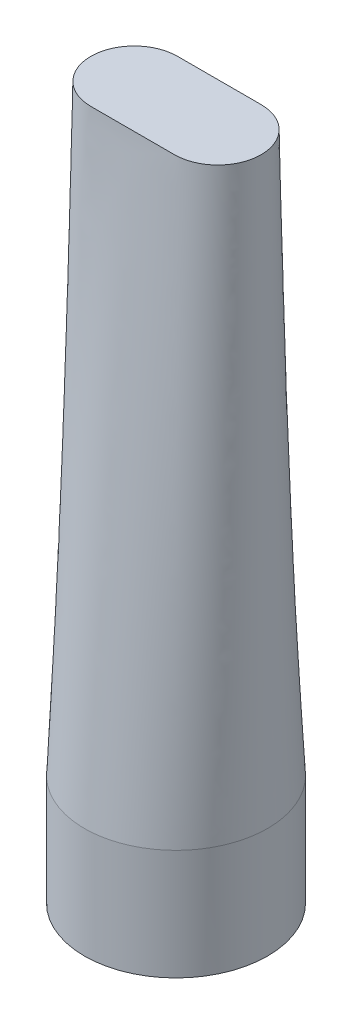
ISO-10303-21;
HEADER;
FILE_DESCRIPTION(('STEP AP214'),'2;1');
FILE_NAME('part.step','',(''),(''),'','','');
FILE_SCHEMA(('AUTOMOTIVE_DESIGN { 1 0 10303 214 1 1 1 1 }'));
ENDSEC;
DATA;
#1=APPLICATION_CONTEXT('core data for automotive mechanical design processes');
#2=APPLICATION_PROTOCOL_DEFINITION('international standard','automotive_design',2000,#1);
#3=PRODUCT_CONTEXT('',#1,'mechanical');
#4=PRODUCT('Part','Part','',(#3));
#5=PRODUCT_RELATED_PRODUCT_CATEGORY('part','',(#4));
#6=PRODUCT_DEFINITION_FORMATION('','',#4);
#7=PRODUCT_DEFINITION_CONTEXT('part definition',#1,'design');
#8=PRODUCT_DEFINITION('design','',#6,#7);
#9=PRODUCT_DEFINITION_SHAPE('','',#8);
#10=(LENGTH_UNIT() NAMED_UNIT(*) SI_UNIT(.MILLI.,.METRE.));
#11=(NAMED_UNIT(*) PLANE_ANGLE_UNIT() SI_UNIT($,.RADIAN.));
#12=(NAMED_UNIT(*) SI_UNIT($,.STERADIAN.) SOLID_ANGLE_UNIT());
#13=UNCERTAINTY_MEASURE_WITH_UNIT(LENGTH_MEASURE(1.E-05),#10,'distance_accuracy_value','');
#14=(GEOMETRIC_REPRESENTATION_CONTEXT(3) GLOBAL_UNCERTAINTY_ASSIGNED_CONTEXT((#13)) GLOBAL_UNIT_ASSIGNED_CONTEXT((#10,
#11,#12)) REPRESENTATION_CONTEXT('',''));
#15=CARTESIAN_POINT('',(0.,0.,0.));
#16=DIRECTION('',(0.,0.,1.));
#17=DIRECTION('',(1.,0.,0.));
#18=AXIS2_PLACEMENT_3D('',#15,#16,#17);
#19=CARTESIAN_POINT('',(0.,40.,0.));
#20=DIRECTION('',(0.,-1.,0.));
#21=DIRECTION('',(0.,0.,-1.));
#22=AXIS2_PLACEMENT_3D('',#19,#20,#21);
#23=CYLINDRICAL_SURFACE('',#22,33.14);
#24=CARTESIAN_POINT('',(-23.0084240085543,40.,-23.8510382298672));
#25=CARTESIAN_POINT('',(-24.7739295383792,40.,-22.1479048303838));
#26=CARTESIAN_POINT('',(-27.7762798876344,40.0000000000001,-18.5020935827906));
#27=CARTESIAN_POINT('',(-30.8969004847793,40.,-12.5696602462047));
#28=CARTESIAN_POINT('',(-32.4284733567699,40.0000000000001,-7.38864691010965));
#29=CARTESIAN_POINT('',(-33.0386889208264,40.,-3.17622212144533));
#30=CARTESIAN_POINT('',(-33.1906394156556,40.,0.));
#31=CARTESIAN_POINT('',(-33.0386889208264,40.,3.17622212144533));
#32=CARTESIAN_POINT('',(-32.4284733567699,40.0000000000001,7.38864691010965));
#33=CARTESIAN_POINT('',(-30.8969004847793,40.,12.5696602462046));
#34=CARTESIAN_POINT('',(-27.7762798876345,40.0000000000001,18.5020935827906));
#35=CARTESIAN_POINT('',(-24.7739295383792,40.,22.1479048303838));
#36=CARTESIAN_POINT('',(-21.6518359566295,40.0000000000001,25.1597004694028));
#37=CARTESIAN_POINT('',(-18.6128056326319,39.9999999999999,27.6437085380081));
#38=CARTESIAN_POINT('',(-13.0949544691808,40.0000000000002,30.6713436139517));
#39=CARTESIAN_POINT('',(-6.77901943484897,40.,32.6718546480956));
#40=CARTESIAN_POINT('',(0.,40.0000000000001,33.3745922504421));
#41=CARTESIAN_POINT('',(6.77901943484895,40.,32.6718546480956));
#42=CARTESIAN_POINT('',(13.0949544691808,40.0000000000001,30.6713436139518));
#43=CARTESIAN_POINT('',(18.6128056326319,40.,27.6437085380081));
#44=CARTESIAN_POINT('',(21.6518359566294,40.,25.1597004694028));
#45=CARTESIAN_POINT('',(24.7739295383792,40.,22.1479048303838));
#46=CARTESIAN_POINT('',(27.7762798876344,40.0000000000002,18.5020935827907));
#47=CARTESIAN_POINT('',(30.8969004847793,39.9999999999998,12.5696602462046));
#48=CARTESIAN_POINT('',(32.4284733567699,40.0000000000002,7.38864691010965));
#49=CARTESIAN_POINT('',(33.0386889208264,40.0000000000001,3.17622212144531));
#50=CARTESIAN_POINT('',(33.1906394156556,39.9999999999999,0.));
#51=CARTESIAN_POINT('',(33.0386889208264,40.0000000000001,-3.17622212144534));
#52=CARTESIAN_POINT('',(32.4284733567699,40.0000000000002,-7.38864691010966));
#53=CARTESIAN_POINT('',(30.8969004847793,39.9999999999999,-12.5696602462047));
#54=CARTESIAN_POINT('',(27.7762798876344,40.0000000000002,-18.5020935827907));
#55=CARTESIAN_POINT('',(24.7739295383791,40.,-22.1479048303838));
#56=CARTESIAN_POINT('',(21.6518359566294,40.,-25.1597004694028));
#57=CARTESIAN_POINT('',(18.6128056326319,40.0000000000001,-27.643708538008));
#58=CARTESIAN_POINT('',(13.0949544691808,40.,-30.6713436139519));
#59=CARTESIAN_POINT('',(6.77901943484895,40.0000000000001,-32.6718546480954));
#60=CARTESIAN_POINT('',(0.,40.,-33.3745922504422));
#61=CARTESIAN_POINT('',(-6.77901943484898,40.0000000000002,-32.6718546480955));
#62=CARTESIAN_POINT('',(-13.0949544691808,39.9999999999999,-30.6713436139518));
#63=CARTESIAN_POINT('',(-18.6128056326319,40.0000000000002,-27.643708538008));
#64=CARTESIAN_POINT('',(-21.6518359566294,40.,-25.1597004694028));
#65=CARTESIAN_POINT('',(-23.0084240085543,40.,-23.8510382298672));
#66=B_SPLINE_CURVE_WITH_KNOTS('',3,(#24,#25,#26,#27,#28,#29,#30,#31,#32,#33,#34,#35,#36,#37,#38,
#39,#40,#41,#42,#43,#44,#45,#46,#47,#48,#49,#50,#51,#52,#53,#54,#55,#56,#57,#58,#59,#60,#61,#62,
#63,#64,#65),.UNSPECIFIED.,.T.,.F.,(4,1,1,1,1,1,1,1,1,1,2,1,1,1,1,1,1,1,2,1,1,1,1,1,1,1,1,1,2,1,
1,1,1,1,1,1,4),(0.,0.0353429814721364,0.070685962944273,0.106028944416409,0.123700435152478,
0.141371925888546,0.159043416624614,0.176714907360682,0.212057888832819,0.247400870304955,
0.282743851777092,0.309900870304955,0.337057888832819,0.364214907360682,0.391371925888546,
0.418528944416409,0.445685962944273,0.472842981472137,0.5,0.535342981472137,0.570685962944273,
0.60602894441641,0.623700435152478,0.641371925888546,0.659043416624614,0.676714907360682,
0.712057888832819,0.747400870304955,0.782743851777092,0.809900870304955,0.837057888832819,
0.864214907360682,0.891371925888546,0.918528944416409,0.945685962944273,0.972842981472136,1.),.UNSPECIFIED.);
#67=CARTESIAN_POINT('',(-23.0084240085543,40.,-23.8510382298672));
#68=VERTEX_POINT('',#67);
#69=EDGE_CURVE('E12',#68,#68,#66,.T.);
#70=ORIENTED_EDGE('',*,*,#69,.F.);
#71=EDGE_LOOP('',(#70));
#72=FACE_BOUND('',#71,.T.);
#73=CARTESIAN_POINT('',(0.,0.,0.));
#74=DIRECTION('',(0.,1.,0.));
#75=DIRECTION('',(0.,0.,1.));
#76=AXIS2_PLACEMENT_3D('',#73,#74,#75);
#77=CIRCLE('',#76,33.14);
#78=CARTESIAN_POINT('',(0.,0.,33.14));
#79=VERTEX_POINT('',#78);
#80=EDGE_CURVE('E122',#79,#79,#77,.T.);
#81=ORIENTED_EDGE('',*,*,#80,.T.);
#82=EDGE_LOOP('',(#81));
#83=FACE_BOUND('',#82,.T.);
#84=ADVANCED_FACE('F112',(#72,#83),#23,.T.);
#85=CARTESIAN_POINT('',(0.,0.,0.));
#86=DIRECTION('',(0.,1.,0.));
#87=DIRECTION('',(1.,0.,0.));
#88=AXIS2_PLACEMENT_3D('',#85,#86,#87);
#89=SPHERICAL_SURFACE('',#88,33.14);
#90=ORIENTED_EDGE('',*,*,#80,.F.);
#91=EDGE_LOOP('',(#90));
#92=FACE_BOUND('',#91,.T.);
#93=ADVANCED_FACE('F176',(#92),#89,.F.);
#94=CARTESIAN_POINT('',(15.1390048867507,250.,0.));
#95=DIRECTION('',(0.,1.,0.));
#96=DIRECTION('',(0.,0.,1.));
#97=AXIS2_PLACEMENT_3D('',#94,#95,#96);
#98=PLANE('',#97);
#99=CARTESIAN_POINT('',(15.1390048867507,250.,0.));
#100=DIRECTION('',(0.,1.,0.));
#101=DIRECTION('',(0.,0.,1.));
#102=AXIS2_PLACEMENT_3D('',#99,#100,#101);
#103=CIRCLE('',#102,15.6934253369185);
#104=CARTESIAN_POINT('',(15.1390048867507,250.,15.6934253369185));
#105=VERTEX_POINT('',#104);
#106=CARTESIAN_POINT('',(15.1390048867704,250.,-15.6934253369186));
#107=VERTEX_POINT('',#106);
#108=EDGE_CURVE('E145',#105,#107,#103,.T.);
#109=ORIENTED_EDGE('',*,*,#108,.T.);
#110=DIRECTION('',(-1.,0.,0.));
#111=VECTOR('',#110,1.);
#112=CARTESIAN_POINT('',(15.1390048867507,250.,-15.6934253369186));
#113=LINE('',#112,#111);
#114=CARTESIAN_POINT('',(-15.1390048860891,250.,-15.6934253369186));
#115=VERTEX_POINT('',#114);
#116=EDGE_CURVE('E129',#107,#115,#113,.T.);
#117=ORIENTED_EDGE('',*,*,#116,.T.);
#118=CARTESIAN_POINT('',(-15.1390048867507,250.,0.));
#119=DIRECTION('',(0.,1.,0.));
#120=DIRECTION('',(0.,0.,1.));
#121=AXIS2_PLACEMENT_3D('',#118,#119,#120);
#122=CIRCLE('',#121,15.6934253369185);
#123=CARTESIAN_POINT('',(-15.1390048867507,250.,15.6934253369185));
#124=VERTEX_POINT('',#123);
#125=EDGE_CURVE('E135',#115,#124,#122,.T.);
#126=ORIENTED_EDGE('',*,*,#125,.T.);
#127=DIRECTION('',(1.,0.,0.));
#128=VECTOR('',#127,1.);
#129=CARTESIAN_POINT('',(15.1390048867507,250.,15.6934253369185));
#130=LINE('',#129,#128);
#131=EDGE_CURVE('E142',#124,#105,#130,.T.);
#132=ORIENTED_EDGE('',*,*,#131,.T.);
#133=EDGE_LOOP('',(#109,#117,#126,#132));
#134=FACE_BOUND('',#133,.T.);
#135=ADVANCED_FACE('F144',(#134),#98,.T.);
#136=CARTESIAN_POINT('',(-15.1390048802491,250.,-15.6934253369186));
#137=CARTESIAN_POINT('',(-23.0084240085543,40.,-23.8510382298672));
#138=CARTESIAN_POINT('',(-13.6982280214288,250.,-15.6934253369186));
#139=CARTESIAN_POINT('',(-21.6518359566294,40.,-25.1597004694028));
#140=CARTESIAN_POINT('',(-10.9756818058248,250.,-15.6934253369186));
#141=CARTESIAN_POINT('',(-18.6128056326319,40.0000000000001,-27.6437085380081));
#142=CARTESIAN_POINT('',(-7.20040404831782,250.,-15.6934253369186));
#143=CARTESIAN_POINT('',(-13.0949544691808,39.9999999999999,-30.6713436139518));
#144=CARTESIAN_POINT('',(-3.56518687748928,250.,-15.6934253369186));
#145=CARTESIAN_POINT('',(-6.77901943484898,40.0000000000001,-32.6718546480955));
#146=CARTESIAN_POINT('',(0.,250.,-15.6934253369186));
#147=CARTESIAN_POINT('',(0.,39.9999999999999,-33.3745922504422));
#148=CARTESIAN_POINT('',(3.56518687748929,250.,-15.6934253369186));
#149=CARTESIAN_POINT('',(6.77901943484896,40.,-32.6718546480954));
#150=CARTESIAN_POINT('',(7.20040404831782,250.,-15.6934253369186));
#151=CARTESIAN_POINT('',(13.0949544691808,40.,-30.6713436139519));
#152=CARTESIAN_POINT('',(10.9756818058248,250.,-15.6934253369186));
#153=CARTESIAN_POINT('',(18.6128056326319,40.,-27.643708538008));
#154=CARTESIAN_POINT('',(13.6982280214288,250.,-15.6934253369186));
#155=CARTESIAN_POINT('',(21.6518359566294,40.,-25.1597004694028));
#156=CARTESIAN_POINT('',(17.0140763198669,250.,-15.6934253369186));
#157=CARTESIAN_POINT('',(24.7739295383791,40.,-22.1479048303838));
#158=CARTESIAN_POINT('',(20.8831144317945,250.000000000001,-15.0134178318319));
#159=CARTESIAN_POINT('',(27.7762798876344,40.0000000000001,-18.5020935827907));
#160=CARTESIAN_POINT('',(26.1725895102293,249.999999999999,-11.7426833747097));
#161=CARTESIAN_POINT('',(30.8969004847793,39.9999999999998,-12.5696602462047));
#162=CARTESIAN_POINT('',(29.2981814679638,250.000000000001,-7.34865843407537));
#163=CARTESIAN_POINT('',(32.4284733567699,40.0000000000002,-7.38864691010966));
#164=CARTESIAN_POINT('',(30.607496372871,250.,-3.23519833676192));
#165=CARTESIAN_POINT('',(33.0386889208264,40.,-3.17622212144534));
#166=CARTESIAN_POINT('',(30.9454915445299,250.,0.));
#167=CARTESIAN_POINT('',(33.1906394156556,39.9999999999999,0.));
#168=CARTESIAN_POINT('',(30.607496372871,250.,3.23519833676181));
#169=CARTESIAN_POINT('',(33.0386889208264,40.,3.17622212144531));
#170=CARTESIAN_POINT('',(29.2981814679637,250.,7.34865843407527));
#171=CARTESIAN_POINT('',(32.4284733567699,40.0000000000002,7.38864691010965));
#172=CARTESIAN_POINT('',(26.1725895102294,249.999999999999,11.7426833747096));
#173=CARTESIAN_POINT('',(30.8969004847793,39.9999999999998,12.5696602462046));
#174=CARTESIAN_POINT('',(20.8831144317945,250.,15.0134178318318));
#175=CARTESIAN_POINT('',(27.7762798876344,40.0000000000001,18.5020935827907));
#176=CARTESIAN_POINT('',(17.0140763198669,250.,15.6934253369185));
#177=CARTESIAN_POINT('',(24.7739295383792,40.,22.1479048303838));
#178=CARTESIAN_POINT('',(13.6982280214288,250.,15.6934253369185));
#179=CARTESIAN_POINT('',(21.6518359566294,40.,25.1597004694028));
#180=CARTESIAN_POINT('',(10.9756818058249,250.,15.6934253369185));
#181=CARTESIAN_POINT('',(18.6128056326319,40.,27.6437085380081));
#182=CARTESIAN_POINT('',(7.20040404831782,250.,15.6934253369185));
#183=CARTESIAN_POINT('',(13.0949544691808,40.,30.6713436139518));
#184=CARTESIAN_POINT('',(3.56518687748928,250.,15.6934253369185));
#185=CARTESIAN_POINT('',(6.77901943484895,40.,32.6718546480956));
#186=CARTESIAN_POINT('',(0.,250.,15.6934253369185));
#187=CARTESIAN_POINT('',(0.,40.0000000000001,33.3745922504421));
#188=CARTESIAN_POINT('',(-3.56518687748929,250.,15.6934253369185));
#189=CARTESIAN_POINT('',(-6.77901943484898,39.9999999999999,32.6718546480956));
#190=CARTESIAN_POINT('',(-7.20040404831782,250.,15.6934253369185));
#191=CARTESIAN_POINT('',(-13.0949544691808,40.0000000000001,30.6713436139517));
#192=CARTESIAN_POINT('',(-10.9756818058249,250.,15.6934253369185));
#193=CARTESIAN_POINT('',(-18.6128056326319,39.9999999999999,27.6437085380081));
#194=CARTESIAN_POINT('',(-13.6982280214288,250.,15.6934253369185));
#195=CARTESIAN_POINT('',(-21.6518359566295,40.,25.1597004694028));
#196=CARTESIAN_POINT('',(-17.0140763198669,250.,15.6934253369185));
#197=CARTESIAN_POINT('',(-24.7739295383792,40.,22.1479048303838));
#198=CARTESIAN_POINT('',(-20.8831144317946,250.,15.0134178318318));
#199=CARTESIAN_POINT('',(-27.7762798876345,40.,18.5020935827906));
#200=CARTESIAN_POINT('',(-26.1725895102293,250.,11.7426833747097));
#201=CARTESIAN_POINT('',(-30.8969004847793,40.,12.5696602462046));
#202=CARTESIAN_POINT('',(-29.2981814679638,250.000000000001,7.34865843407523));
#203=CARTESIAN_POINT('',(-32.4284733567699,40.,7.38864691010965));
#204=CARTESIAN_POINT('',(-30.6074963728709,250.,3.23519833676187));
#205=CARTESIAN_POINT('',(-33.0386889208264,40.,3.17622212144533));
#206=CARTESIAN_POINT('',(-30.94549154453,249.999999999999,0.));
#207=CARTESIAN_POINT('',(-33.1906394156556,39.9999999999999,0.));
#208=CARTESIAN_POINT('',(-30.6074963728709,250.000000000001,-3.23519833676188));
#209=CARTESIAN_POINT('',(-33.0386889208264,40.,-3.17622212144533));
#210=CARTESIAN_POINT('',(-29.2981814679639,249.999999999999,-7.34865843407538));
#211=CARTESIAN_POINT('',(-32.4284733567699,40.0000000000001,-7.38864691010965));
#212=CARTESIAN_POINT('',(-26.1725895102292,250.,-11.7426833747096));
#213=CARTESIAN_POINT('',(-30.8969004847793,39.9999999999999,-12.5696602462047));
#214=CARTESIAN_POINT('',(-20.8831144317946,250.,-15.0134178318319));
#215=CARTESIAN_POINT('',(-27.7762798876344,40.,-18.5020935827906));
#216=CARTESIAN_POINT('',(-17.0140763198669,250.,-15.6934253369186));
#217=CARTESIAN_POINT('',(-24.7739295383792,40.,-22.1479048303838));
#218=CARTESIAN_POINT('',(-15.1390048802491,250.,-15.6934253369186));
#219=CARTESIAN_POINT('',(-23.0084240085543,40.,-23.8510382298672));
#220=B_SPLINE_SURFACE_WITH_KNOTS('',3,1,((#136,#137),(#138,#139),(#140,#141),(#142,#143),(#144,
#145),(#146,#147),(#148,#149),(#150,#151),(#152,#153),(#154,#155),(#156,#157),(#158,#159),(#160,
#161),(#162,#163),(#164,#165),(#166,#167),(#168,#169),(#170,#171),(#172,#173),(#174,#175),(#176,
#177),(#178,#179),(#180,#181),(#182,#183),(#184,#185),(#186,#187),(#188,#189),(#190,#191),(#192,
#193),(#194,#195),(#196,#197),(#198,#199),(#200,#201),(#202,#203),(#204,#205),(#206,#207),(#208,
#209),(#210,#211),(#212,#213),(#214,#215),(#216,#217),(#218,#219)),.UNSPECIFIED.,.T.,.F.,.F.,(4,
1,1,1,1,1,1,1,2,1,1,1,1,1,1,1,1,1,2,1,1,1,1,1,1,1,2,1,1,1,1,1,1,1,1,1,4),(2,2),(0.,
0.0271570185278635,0.054314037055727,0.0814710555835906,0.108628074111454,0.135785092639318,
0.162942111167181,0.190099129695045,0.217256148222908,0.252599129695045,0.287942111167181,
0.323285092639318,0.340956583375386,0.358628074111454,0.376299564847522,0.39397105558359,
0.429314037055727,0.464657018527863,0.5,0.527157018527863,0.554314037055727,0.581471055583591,
0.608628074111454,0.635785092639318,0.662942111167181,0.690099129695045,0.717256148222908,
0.752599129695045,0.787942111167181,0.823285092639318,0.840956583375386,0.858628074111454,
0.876299564847522,0.893971055583591,0.929314037055727,0.964657018527864,1.),(0.,1.),.UNSPECIFIED.);
#221=ORIENTED_EDGE('',*,*,#125,.F.);
#222=ORIENTED_EDGE('',*,*,#116,.F.);
#223=ORIENTED_EDGE('',*,*,#108,.F.);
#224=ORIENTED_EDGE('',*,*,#131,.F.);
#225=EDGE_LOOP('',(#221,#222,#223,#224));
#226=FACE_BOUND('',#225,.T.);
#227=ORIENTED_EDGE('',*,*,#69,.T.);
#228=EDGE_LOOP('',(#227));
#229=FACE_BOUND('',#228,.T.);
#230=ADVANCED_FACE('F153',(#226,#229),#220,.T.);
#231=CLOSED_SHELL('',(#84,#93,#135,#230));
#232=MANIFOLD_SOLID_BREP('B2',#231);
#233=ADVANCED_BREP_SHAPE_REPRESENTATION('',(#18,#232),#14);
#234=SHAPE_DEFINITION_REPRESENTATION(#9,#233);
ENDSEC;
END-ISO-10303-21;
